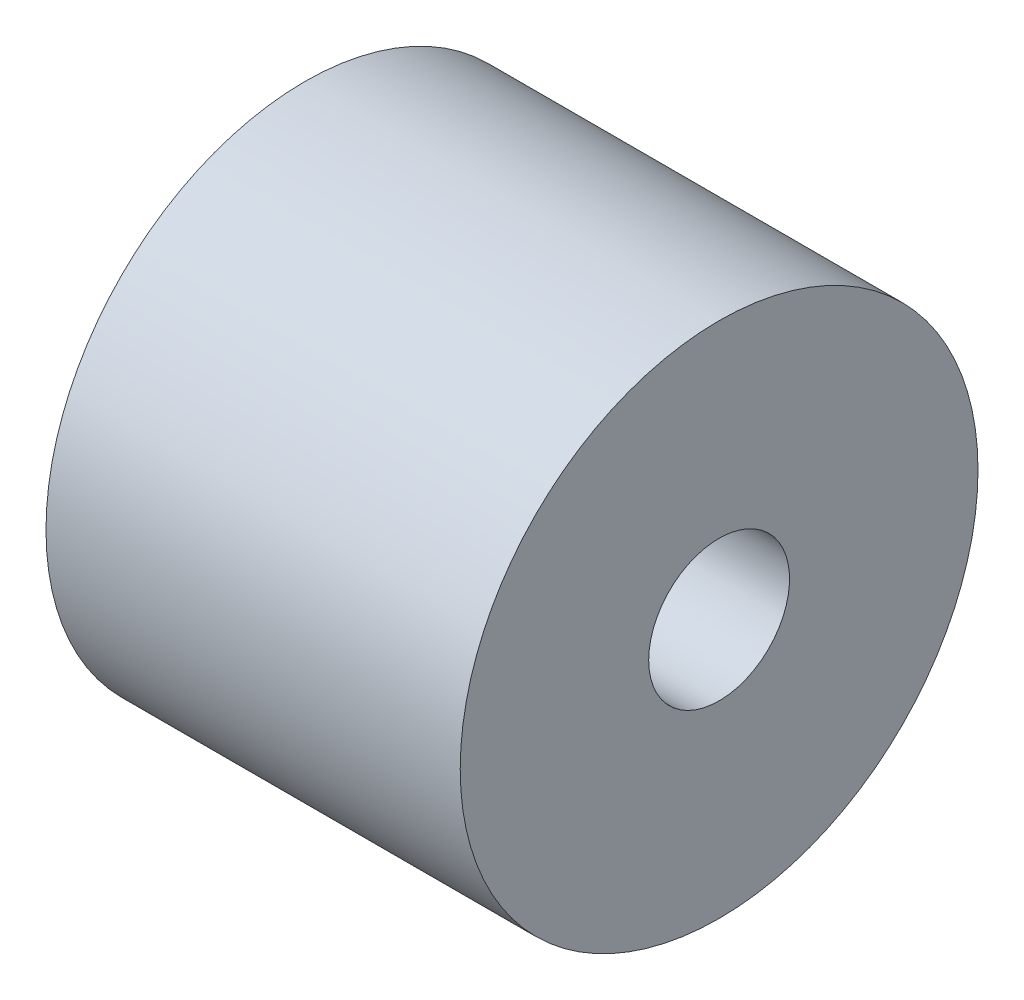
ISO-10303-21;
HEADER;
FILE_DESCRIPTION(('STEP AP214'),'2;1');
FILE_NAME('part.step','',(''),(''),'','','');
FILE_SCHEMA(('AUTOMOTIVE_DESIGN { 1 0 10303 214 1 1 1 1 }'));
ENDSEC;
DATA;
#1=APPLICATION_CONTEXT('core data for automotive mechanical design processes');
#2=APPLICATION_PROTOCOL_DEFINITION('international standard','automotive_design',2000,#1);
#3=PRODUCT_CONTEXT('',#1,'mechanical');
#4=PRODUCT('Part','Part','',(#3));
#5=PRODUCT_RELATED_PRODUCT_CATEGORY('part','',(#4));
#6=PRODUCT_DEFINITION_FORMATION('','',#4);
#7=PRODUCT_DEFINITION_CONTEXT('part definition',#1,'design');
#8=PRODUCT_DEFINITION('design','',#6,#7);
#9=PRODUCT_DEFINITION_SHAPE('','',#8);
#10=(LENGTH_UNIT() NAMED_UNIT(*) SI_UNIT(.MILLI.,.METRE.));
#11=(NAMED_UNIT(*) PLANE_ANGLE_UNIT() SI_UNIT($,.RADIAN.));
#12=(NAMED_UNIT(*) SI_UNIT($,.STERADIAN.) SOLID_ANGLE_UNIT());
#13=UNCERTAINTY_MEASURE_WITH_UNIT(LENGTH_MEASURE(1.E-05),#10,'distance_accuracy_value','');
#14=(GEOMETRIC_REPRESENTATION_CONTEXT(3) GLOBAL_UNCERTAINTY_ASSIGNED_CONTEXT((#13)) GLOBAL_UNIT_ASSIGNED_CONTEXT((#10,
#11,#12)) REPRESENTATION_CONTEXT('',''));
#15=CARTESIAN_POINT('',(0.,0.,0.));
#16=DIRECTION('',(0.,0.,1.));
#17=DIRECTION('',(1.,0.,0.));
#18=AXIS2_PLACEMENT_3D('',#15,#16,#17);
#19=CARTESIAN_POINT('',(0.,0.,0.));
#20=DIRECTION('',(-1.,0.,0.));
#21=DIRECTION('',(0.,0.,1.));
#22=AXIS2_PLACEMENT_3D('',#19,#20,#21);
#23=PLANE('',#22);
#24=CARTESIAN_POINT('',(0.,0.,0.));
#25=DIRECTION('',(-1.,0.,0.));
#26=DIRECTION('',(0.,0.,1.));
#27=AXIS2_PLACEMENT_3D('',#24,#25,#26);
#28=CIRCLE('',#27,3.39999999999999);
#29=CARTESIAN_POINT('',(0.,0.,3.39999999999999));
#30=VERTEX_POINT('',#29);
#31=EDGE_CURVE('E45',#30,#30,#28,.T.);
#32=ORIENTED_EDGE('',*,*,#31,.T.);
#33=EDGE_LOOP('',(#32));
#34=FACE_BOUND('',#33,.T.);
#35=CARTESIAN_POINT('',(0.,0.,0.));
#36=DIRECTION('',(-1.,0.,0.));
#37=DIRECTION('',(0.,0.,1.));
#38=AXIS2_PLACEMENT_3D('',#35,#36,#37);
#39=CIRCLE('',#38,12.5);
#40=CARTESIAN_POINT('',(0.,0.,12.5));
#41=VERTEX_POINT('',#40);
#42=EDGE_CURVE('E10',#41,#41,#39,.T.);
#43=ORIENTED_EDGE('',*,*,#42,.F.);
#44=EDGE_LOOP('',(#43));
#45=FACE_BOUND('',#44,.T.);
#46=ADVANCED_FACE('F35',(#34,#45),#23,.F.);
#47=CARTESIAN_POINT('',(-1000.,0.,0.));
#48=DIRECTION('',(-1.,0.,0.));
#49=DIRECTION('',(0.,0.,1.));
#50=AXIS2_PLACEMENT_3D('',#47,#48,#49);
#51=CYLINDRICAL_SURFACE('',#50,12.5);
#52=CARTESIAN_POINT('',(-19.9999999999999,0.,0.));
#53=DIRECTION('',(-1.,0.,0.));
#54=DIRECTION('',(0.,0.,1.));
#55=AXIS2_PLACEMENT_3D('',#52,#53,#54);
#56=CIRCLE('',#55,12.5);
#57=CARTESIAN_POINT('',(-19.9999999999999,0.,12.5));
#58=VERTEX_POINT('',#57);
#59=EDGE_CURVE('E41',#58,#58,#56,.T.);
#60=ORIENTED_EDGE('',*,*,#59,.F.);
#61=EDGE_LOOP('',(#60));
#62=FACE_BOUND('',#61,.T.);
#63=ORIENTED_EDGE('',*,*,#42,.T.);
#64=EDGE_LOOP('',(#63));
#65=FACE_BOUND('',#64,.T.);
#66=ADVANCED_FACE('F59',(#62,#65),#51,.T.);
#67=CARTESIAN_POINT('',(-19.9999999999999,12.5,0.));
#68=DIRECTION('',(1.,0.,0.));
#69=DIRECTION('',(0.,0.,-1.));
#70=AXIS2_PLACEMENT_3D('',#67,#68,#69);
#71=PLANE('',#70);
#72=CARTESIAN_POINT('',(-19.9999999999999,0.,0.));
#73=DIRECTION('',(-1.,0.,0.));
#74=DIRECTION('',(0.,0.,1.));
#75=AXIS2_PLACEMENT_3D('',#72,#73,#74);
#76=CIRCLE('',#75,3.39999999999999);
#77=CARTESIAN_POINT('',(-19.9999999999999,0.,3.39999999999999));
#78=VERTEX_POINT('',#77);
#79=EDGE_CURVE('E49',#78,#78,#76,.T.);
#80=ORIENTED_EDGE('',*,*,#79,.F.);
#81=EDGE_LOOP('',(#80));
#82=FACE_BOUND('',#81,.T.);
#83=ORIENTED_EDGE('',*,*,#59,.T.);
#84=EDGE_LOOP('',(#83));
#85=FACE_BOUND('',#84,.T.);
#86=ADVANCED_FACE('F57',(#82,#85),#71,.F.);
#87=CARTESIAN_POINT('',(-19.9999999999999,0.,0.));
#88=DIRECTION('',(-1.,0.,0.));
#89=DIRECTION('',(0.,0.,1.));
#90=AXIS2_PLACEMENT_3D('',#87,#88,#89);
#91=CYLINDRICAL_SURFACE('',#90,3.39999999999999);
#92=ORIENTED_EDGE('',*,*,#31,.F.);
#93=EDGE_LOOP('',(#92));
#94=FACE_BOUND('',#93,.T.);
#95=ORIENTED_EDGE('',*,*,#79,.T.);
#96=EDGE_LOOP('',(#95));
#97=FACE_BOUND('',#96,.T.);
#98=ADVANCED_FACE('F55',(#94,#97),#91,.F.);
#99=CLOSED_SHELL('',(#46,#66,#86,#98));
#100=MANIFOLD_SOLID_BREP('B2',#99);
#101=ADVANCED_BREP_SHAPE_REPRESENTATION('',(#18,#100),#14);
#102=SHAPE_DEFINITION_REPRESENTATION(#9,#101);
ENDSEC;
END-ISO-10303-21;
